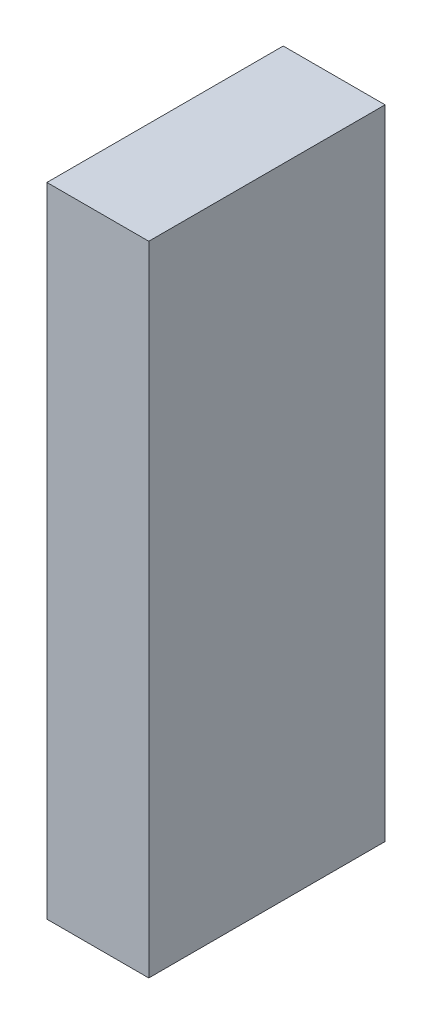
ISO-10303-21;
HEADER;
FILE_DESCRIPTION(('STEP AP214'),'2;1');
FILE_NAME('part.step','',(''),(''),'','','');
FILE_SCHEMA(('AUTOMOTIVE_DESIGN { 1 0 10303 214 1 1 1 1 }'));
ENDSEC;
DATA;
#1=APPLICATION_CONTEXT('core data for automotive mechanical design processes');
#2=APPLICATION_PROTOCOL_DEFINITION('international standard','automotive_design',2000,#1);
#3=PRODUCT_CONTEXT('',#1,'mechanical');
#4=PRODUCT('Part','Part','',(#3));
#5=PRODUCT_RELATED_PRODUCT_CATEGORY('part','',(#4));
#6=PRODUCT_DEFINITION_FORMATION('','',#4);
#7=PRODUCT_DEFINITION_CONTEXT('part definition',#1,'design');
#8=PRODUCT_DEFINITION('design','',#6,#7);
#9=PRODUCT_DEFINITION_SHAPE('','',#8);
#10=(LENGTH_UNIT() NAMED_UNIT(*) SI_UNIT(.MILLI.,.METRE.));
#11=(NAMED_UNIT(*) PLANE_ANGLE_UNIT() SI_UNIT($,.RADIAN.));
#12=(NAMED_UNIT(*) SI_UNIT($,.STERADIAN.) SOLID_ANGLE_UNIT());
#13=UNCERTAINTY_MEASURE_WITH_UNIT(LENGTH_MEASURE(1.E-05),#10,'distance_accuracy_value','');
#14=(GEOMETRIC_REPRESENTATION_CONTEXT(3) GLOBAL_UNCERTAINTY_ASSIGNED_CONTEXT((#13)) GLOBAL_UNIT_ASSIGNED_CONTEXT((#10,
#11,#12)) REPRESENTATION_CONTEXT('',''));
#15=CARTESIAN_POINT('',(0.,0.,0.));
#16=DIRECTION('',(0.,0.,1.));
#17=DIRECTION('',(1.,0.,0.));
#18=AXIS2_PLACEMENT_3D('',#15,#16,#17);
#19=CARTESIAN_POINT('',(0.3955,1.35,0.));
#20=DIRECTION('',(1.,0.,0.));
#21=DIRECTION('',(0.,0.,-1.));
#22=AXIS2_PLACEMENT_3D('',#19,#20,#21);
#23=PLANE('',#22);
#24=DIRECTION('',(0.,0.,-1.));
#25=VECTOR('',#24,1.);
#26=CARTESIAN_POINT('',(0.3955,-1.35,0.));
#27=LINE('',#26,#25);
#28=CARTESIAN_POINT('',(0.3955,-1.35,0.));
#29=VERTEX_POINT('',#28);
#30=CARTESIAN_POINT('',(0.3955,-1.35,1.));
#31=VERTEX_POINT('',#30);
#32=EDGE_CURVE('E20',#29,#31,#27,.F.);
#33=ORIENTED_EDGE('',*,*,#32,.F.);
#34=DIRECTION('',(0.,1.,0.));
#35=VECTOR('',#34,1.);
#36=CARTESIAN_POINT('',(0.3955,-1.35,0.));
#37=LINE('',#36,#35);
#38=CARTESIAN_POINT('',(0.3955,1.35,0.));
#39=VERTEX_POINT('',#38);
#40=EDGE_CURVE('E80',#29,#39,#37,.T.);
#41=ORIENTED_EDGE('',*,*,#40,.T.);
#42=DIRECTION('',(0.,0.,1.));
#43=VECTOR('',#42,1.);
#44=CARTESIAN_POINT('',(0.3955,1.35,0.));
#45=LINE('',#44,#43);
#46=CARTESIAN_POINT('',(0.3955,1.35,1.));
#47=VERTEX_POINT('',#46);
#48=EDGE_CURVE('E68',#47,#39,#45,.F.);
#49=ORIENTED_EDGE('',*,*,#48,.F.);
#50=DIRECTION('',(0.,1.,0.));
#51=VECTOR('',#50,1.);
#52=CARTESIAN_POINT('',(0.3955,-1.35,1.));
#53=LINE('',#52,#51);
#54=EDGE_CURVE('E56',#31,#47,#53,.T.);
#55=ORIENTED_EDGE('',*,*,#54,.F.);
#56=EDGE_LOOP('',(#33,#41,#49,#55));
#57=FACE_BOUND('',#56,.T.);
#58=ADVANCED_FACE('F17',(#57),#23,.T.);
#59=CARTESIAN_POINT('',(0.3955,-1.35,0.));
#60=DIRECTION('',(0.,-1.,0.));
#61=DIRECTION('',(0.,0.,-1.));
#62=AXIS2_PLACEMENT_3D('',#59,#60,#61);
#63=PLANE('',#62);
#64=DIRECTION('',(0.,0.,1.));
#65=VECTOR('',#64,1.);
#66=CARTESIAN_POINT('',(-0.0355,-1.35,0.));
#67=LINE('',#66,#65);
#68=CARTESIAN_POINT('',(-0.0355,-1.35,0.));
#69=VERTEX_POINT('',#68);
#70=CARTESIAN_POINT('',(-0.0355,-1.35,1.));
#71=VERTEX_POINT('',#70);
#72=EDGE_CURVE('E83',#69,#71,#67,.T.);
#73=ORIENTED_EDGE('',*,*,#72,.F.);
#74=DIRECTION('',(1.,0.,0.));
#75=VECTOR('',#74,1.);
#76=CARTESIAN_POINT('',(-0.0355,-1.35,0.));
#77=LINE('',#76,#75);
#78=EDGE_CURVE('E65',#69,#29,#77,.T.);
#79=ORIENTED_EDGE('',*,*,#78,.T.);
#80=ORIENTED_EDGE('',*,*,#32,.T.);
#81=DIRECTION('',(1.,0.,0.));
#82=VECTOR('',#81,1.);
#83=CARTESIAN_POINT('',(-0.0355,-1.35,1.));
#84=LINE('',#83,#82);
#85=EDGE_CURVE('E62',#71,#31,#84,.T.);
#86=ORIENTED_EDGE('',*,*,#85,.F.);
#87=EDGE_LOOP('',(#73,#79,#80,#86));
#88=FACE_BOUND('',#87,.T.);
#89=ADVANCED_FACE('F61',(#88),#63,.T.);
#90=CARTESIAN_POINT('',(-0.0355,-1.35,1.));
#91=DIRECTION('',(0.,0.,1.));
#92=DIRECTION('',(1.,0.,0.));
#93=AXIS2_PLACEMENT_3D('',#90,#91,#92);
#94=PLANE('',#93);
#95=DIRECTION('',(1.,0.,0.));
#96=VECTOR('',#95,1.);
#97=CARTESIAN_POINT('',(-0.0355,1.35,1.));
#98=LINE('',#97,#96);
#99=CARTESIAN_POINT('',(-0.0355,1.35,1.));
#100=VERTEX_POINT('',#99);
#101=EDGE_CURVE('E70',#100,#47,#98,.T.);
#102=ORIENTED_EDGE('',*,*,#101,.F.);
#103=DIRECTION('',(0.,1.,0.));
#104=VECTOR('',#103,1.);
#105=CARTESIAN_POINT('',(-0.0355,-1.35,1.));
#106=LINE('',#105,#104);
#107=EDGE_CURVE('E74',#71,#100,#106,.T.);
#108=ORIENTED_EDGE('',*,*,#107,.F.);
#109=ORIENTED_EDGE('',*,*,#85,.T.);
#110=ORIENTED_EDGE('',*,*,#54,.T.);
#111=EDGE_LOOP('',(#102,#108,#109,#110));
#112=FACE_BOUND('',#111,.T.);
#113=ADVANCED_FACE('F72',(#112),#94,.T.);
#114=CARTESIAN_POINT('',(-0.0355,1.35,0.));
#115=DIRECTION('',(0.,1.,0.));
#116=DIRECTION('',(0.,0.,1.));
#117=AXIS2_PLACEMENT_3D('',#114,#115,#116);
#118=PLANE('',#117);
#119=ORIENTED_EDGE('',*,*,#48,.T.);
#120=DIRECTION('',(1.,0.,0.));
#121=VECTOR('',#120,1.);
#122=CARTESIAN_POINT('',(-0.0355,1.35,0.));
#123=LINE('',#122,#121);
#124=CARTESIAN_POINT('',(-0.0355,1.35,0.));
#125=VERTEX_POINT('',#124);
#126=EDGE_CURVE('E35',#39,#125,#123,.F.);
#127=ORIENTED_EDGE('',*,*,#126,.T.);
#128=DIRECTION('',(0.,0.,1.));
#129=VECTOR('',#128,1.);
#130=CARTESIAN_POINT('',(-0.0355,1.35,0.));
#131=LINE('',#130,#129);
#132=EDGE_CURVE('E26',#100,#125,#131,.F.);
#133=ORIENTED_EDGE('',*,*,#132,.F.);
#134=ORIENTED_EDGE('',*,*,#101,.T.);
#135=EDGE_LOOP('',(#119,#127,#133,#134));
#136=FACE_BOUND('',#135,.T.);
#137=ADVANCED_FACE('F89',(#136),#118,.T.);
#138=CARTESIAN_POINT('',(-0.0355,-1.35,0.));
#139=DIRECTION('',(0.,0.,1.));
#140=DIRECTION('',(1.,0.,0.));
#141=AXIS2_PLACEMENT_3D('',#138,#139,#140);
#142=PLANE('',#141);
#143=ORIENTED_EDGE('',*,*,#126,.F.);
#144=ORIENTED_EDGE('',*,*,#40,.F.);
#145=ORIENTED_EDGE('',*,*,#78,.F.);
#146=DIRECTION('',(0.,1.,0.));
#147=VECTOR('',#146,1.);
#148=CARTESIAN_POINT('',(-0.0355,-1.35,0.));
#149=LINE('',#148,#147);
#150=EDGE_CURVE('E11',#125,#69,#149,.F.);
#151=ORIENTED_EDGE('',*,*,#150,.F.);
#152=EDGE_LOOP('',(#143,#144,#145,#151));
#153=FACE_BOUND('',#152,.T.);
#154=ADVANCED_FACE('F91',(#153),#142,.F.);
#155=CARTESIAN_POINT('',(-0.0355,-1.35,0.));
#156=DIRECTION('',(-1.,0.,0.));
#157=DIRECTION('',(0.,0.,1.));
#158=AXIS2_PLACEMENT_3D('',#155,#156,#157);
#159=PLANE('',#158);
#160=ORIENTED_EDGE('',*,*,#132,.T.);
#161=ORIENTED_EDGE('',*,*,#150,.T.);
#162=ORIENTED_EDGE('',*,*,#72,.T.);
#163=ORIENTED_EDGE('',*,*,#107,.T.);
#164=EDGE_LOOP('',(#160,#161,#162,#163));
#165=FACE_BOUND('',#164,.T.);
#166=ADVANCED_FACE('F88',(#165),#159,.T.);
#167=CLOSED_SHELL('',(#58,#89,#113,#137,#154,#166));
#168=MANIFOLD_SOLID_BREP('B1',#167);
#169=ADVANCED_BREP_SHAPE_REPRESENTATION('',(#18,#168),#14);
#170=SHAPE_DEFINITION_REPRESENTATION(#9,#169);
ENDSEC;
END-ISO-10303-21;
